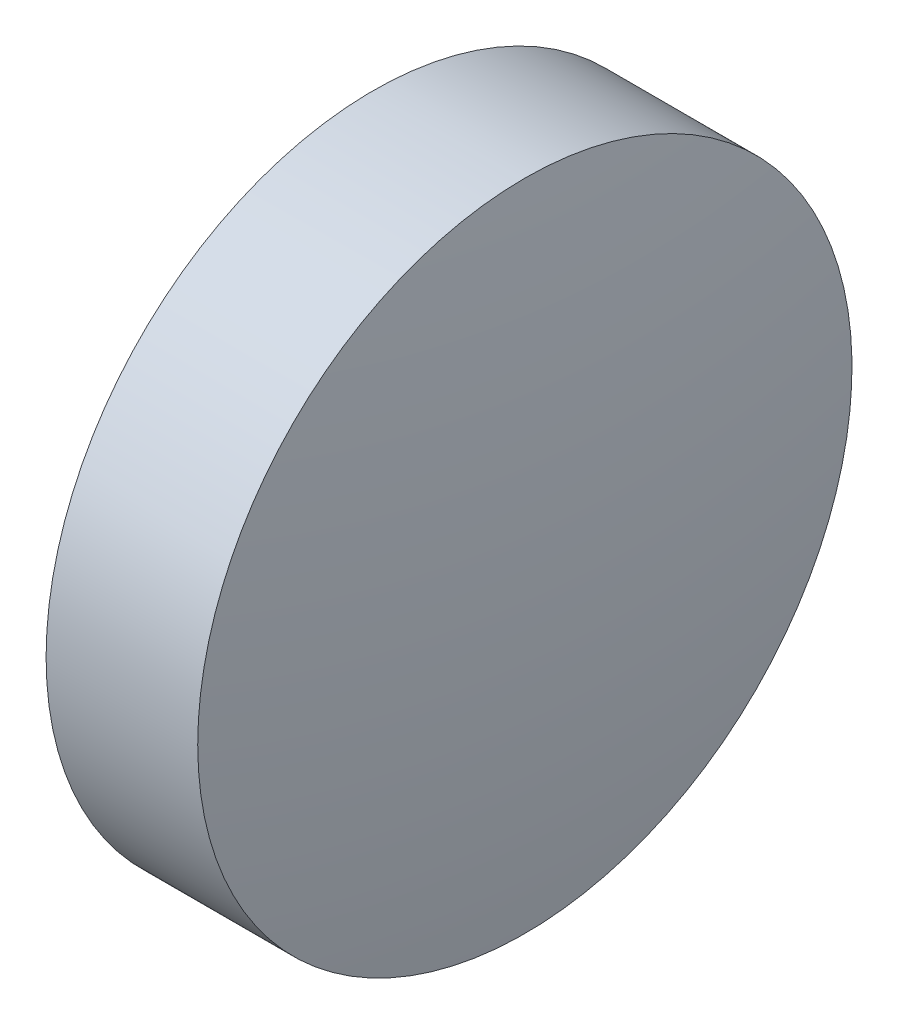
ISO-10303-21;
HEADER;
FILE_DESCRIPTION(('STEP AP214'),'2;1');
FILE_NAME('part.step','',(''),(''),'','','');
FILE_SCHEMA(('AUTOMOTIVE_DESIGN { 1 0 10303 214 1 1 1 1 }'));
ENDSEC;
DATA;
#1=APPLICATION_CONTEXT('core data for automotive mechanical design processes');
#2=APPLICATION_PROTOCOL_DEFINITION('international standard','automotive_design',2000,#1);
#3=PRODUCT_CONTEXT('',#1,'mechanical');
#4=PRODUCT('Part','Part','',(#3));
#5=PRODUCT_RELATED_PRODUCT_CATEGORY('part','',(#4));
#6=PRODUCT_DEFINITION_FORMATION('','',#4);
#7=PRODUCT_DEFINITION_CONTEXT('part definition',#1,'design');
#8=PRODUCT_DEFINITION('design','',#6,#7);
#9=PRODUCT_DEFINITION_SHAPE('','',#8);
#10=(LENGTH_UNIT() NAMED_UNIT(*) SI_UNIT(.MILLI.,.METRE.));
#11=(NAMED_UNIT(*) PLANE_ANGLE_UNIT() SI_UNIT($,.RADIAN.));
#12=(NAMED_UNIT(*) SI_UNIT($,.STERADIAN.) SOLID_ANGLE_UNIT());
#13=UNCERTAINTY_MEASURE_WITH_UNIT(LENGTH_MEASURE(1.E-05),#10,'distance_accuracy_value','');
#14=(GEOMETRIC_REPRESENTATION_CONTEXT(3) GLOBAL_UNCERTAINTY_ASSIGNED_CONTEXT((#13)) GLOBAL_UNIT_ASSIGNED_CONTEXT((#10,
#11,#12)) REPRESENTATION_CONTEXT('',''));
#15=CARTESIAN_POINT('',(0.,0.,0.));
#16=DIRECTION('',(0.,0.,1.));
#17=DIRECTION('',(1.,0.,0.));
#18=AXIS2_PLACEMENT_3D('',#15,#16,#17);
#19=CARTESIAN_POINT('',(799.37099246753,336.559230443648,0.));
#20=DIRECTION('',(-1.,0.,0.));
#21=DIRECTION('',(0.,1.,0.));
#22=AXIS2_PLACEMENT_3D('',#19,#20,#21);
#23=SPHERICAL_SURFACE('',#22,20.7918749999999);
#24=CARTESIAN_POINT('',(819.92286746753,336.559230443649,0.));
#25=DIRECTION('',(-1.,0.,0.));
#26=DIRECTION('',(0.,0.,1.));
#27=AXIS2_PLACEMENT_3D('',#24,#25,#26);
#28=CIRCLE('',#27,3.14999999999988);
#29=CARTESIAN_POINT('',(819.92286746753,336.559230443649,3.14999999999988));
#30=VERTEX_POINT('',#29);
#31=EDGE_CURVE('E10',#30,#30,#28,.T.);
#32=ORIENTED_EDGE('',*,*,#31,.F.);
#33=EDGE_LOOP('',(#32));
#34=FACE_BOUND('',#33,.T.);
#35=ADVANCED_FACE('F35',(#34),#23,.T.);
#36=CARTESIAN_POINT('',(798.266287631591,336.559230443649,0.));
#37=DIRECTION('',(-1.,0.,0.));
#38=DIRECTION('',(0.,0.,1.));
#39=AXIS2_PLACEMENT_3D('',#36,#37,#38);
#40=CYLINDRICAL_SURFACE('',#39,3.14999999999988);
#41=CARTESIAN_POINT('',(818.46286746753,336.559230443649,0.));
#42=DIRECTION('',(-1.,0.,0.));
#43=DIRECTION('',(0.,0.,1.));
#44=AXIS2_PLACEMENT_3D('',#41,#42,#43);
#45=CIRCLE('',#44,3.14999999999988);
#46=CARTESIAN_POINT('',(818.46286746753,336.559230443649,3.14999999999988));
#47=VERTEX_POINT('',#46);
#48=EDGE_CURVE('E41',#47,#47,#45,.T.);
#49=ORIENTED_EDGE('',*,*,#48,.F.);
#50=EDGE_LOOP('',(#49));
#51=FACE_BOUND('',#50,.T.);
#52=ORIENTED_EDGE('',*,*,#31,.T.);
#53=EDGE_LOOP('',(#52));
#54=FACE_BOUND('',#53,.T.);
#55=ADVANCED_FACE('F49',(#51,#54),#40,.T.);
#56=CARTESIAN_POINT('',(818.46286746753,336.559230443649,0.));
#57=DIRECTION('',(1.,0.,0.));
#58=DIRECTION('',(0.,0.,-1.));
#59=AXIS2_PLACEMENT_3D('',#56,#57,#58);
#60=PLANE('',#59);
#61=ORIENTED_EDGE('',*,*,#48,.T.);
#62=EDGE_LOOP('',(#61));
#63=FACE_BOUND('',#62,.T.);
#64=ADVANCED_FACE('F47',(#63),#60,.F.);
#65=CLOSED_SHELL('',(#35,#55,#64));
#66=MANIFOLD_SOLID_BREP('B2',#65);
#67=ADVANCED_BREP_SHAPE_REPRESENTATION('',(#18,#66),#14);
#68=SHAPE_DEFINITION_REPRESENTATION(#9,#67);
ENDSEC;
END-ISO-10303-21;
